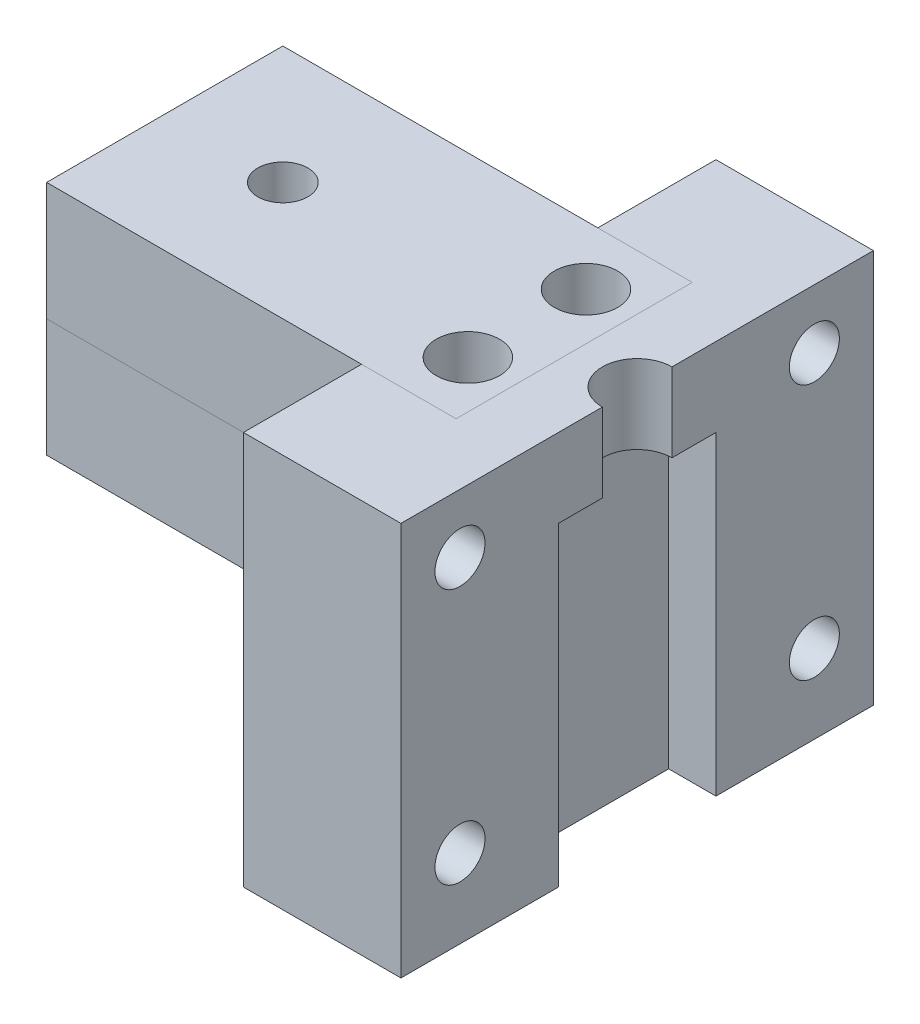
ISO-10303-21;
HEADER;
FILE_DESCRIPTION(('STEP AP214'),'2;1');
FILE_NAME('part.step','',(''),(''),'','','');
FILE_SCHEMA(('AUTOMOTIVE_DESIGN { 1 0 10303 214 1 1 1 1 }'));
ENDSEC;
DATA;
#1=APPLICATION_CONTEXT('core data for automotive mechanical design processes');
#2=APPLICATION_PROTOCOL_DEFINITION('international standard','automotive_design',2000,#1);
#3=PRODUCT_CONTEXT('',#1,'mechanical');
#4=PRODUCT('Part','Part','',(#3));
#5=PRODUCT_RELATED_PRODUCT_CATEGORY('part','',(#4));
#6=PRODUCT_DEFINITION_FORMATION('','',#4);
#7=PRODUCT_DEFINITION_CONTEXT('part definition',#1,'design');
#8=PRODUCT_DEFINITION('design','',#6,#7);
#9=PRODUCT_DEFINITION_SHAPE('','',#8);
#10=(LENGTH_UNIT() NAMED_UNIT(*) SI_UNIT(.MILLI.,.METRE.));
#11=(NAMED_UNIT(*) PLANE_ANGLE_UNIT() SI_UNIT($,.RADIAN.));
#12=(NAMED_UNIT(*) SI_UNIT($,.STERADIAN.) SOLID_ANGLE_UNIT());
#13=UNCERTAINTY_MEASURE_WITH_UNIT(LENGTH_MEASURE(1.E-05),#10,'distance_accuracy_value','');
#14=(GEOMETRIC_REPRESENTATION_CONTEXT(3) GLOBAL_UNCERTAINTY_ASSIGNED_CONTEXT((#13)) GLOBAL_UNIT_ASSIGNED_CONTEXT((#10,
#11,#12)) REPRESENTATION_CONTEXT('',''));
#15=CARTESIAN_POINT('',(0.,0.,0.));
#16=DIRECTION('',(0.,0.,1.));
#17=DIRECTION('',(1.,0.,0.));
#18=AXIS2_PLACEMENT_3D('',#15,#16,#17);
#19=CARTESIAN_POINT('',(-5.08,0.,0.));
#20=DIRECTION('',(-1.,0.,0.));
#21=DIRECTION('',(0.,0.,1.));
#22=AXIS2_PLACEMENT_3D('',#19,#20,#21);
#23=PLANE('',#22);
#24=DIRECTION('',(0.,-1.,0.));
#25=VECTOR('',#24,1.);
#26=CARTESIAN_POINT('',(-5.08,0.,-9.525));
#27=LINE('',#26,#25);
#28=CARTESIAN_POINT('',(-5.08000000002085,0.,-9.525));
#29=VERTEX_POINT('',#28);
#30=CARTESIAN_POINT('',(-5.08000000002085,-9.525,-9.525));
#31=VERTEX_POINT('',#30);
#32=EDGE_CURVE('E123',#29,#31,#27,.T.);
#33=ORIENTED_EDGE('',*,*,#32,.F.);
#34=DIRECTION('',(0.,0.,-1.));
#35=VECTOR('',#34,1.);
#36=CARTESIAN_POINT('',(-5.08,0.,-9.525));
#37=LINE('',#36,#35);
#38=CARTESIAN_POINT('',(-5.08000000002085,0.,9.525));
#39=VERTEX_POINT('',#38);
#40=EDGE_CURVE('E79',#39,#29,#37,.T.);
#41=ORIENTED_EDGE('',*,*,#40,.F.);
#42=DIRECTION('',(0.,-1.,0.));
#43=VECTOR('',#42,1.);
#44=CARTESIAN_POINT('',(-5.08000000002085,-9.525,9.525));
#45=LINE('',#44,#43);
#46=CARTESIAN_POINT('',(-5.08000000002085,-9.525,9.525));
#47=VERTEX_POINT('',#46);
#48=EDGE_CURVE('E184',#39,#47,#45,.T.);
#49=ORIENTED_EDGE('',*,*,#48,.T.);
#50=DIRECTION('',(0.,0.,1.));
#51=VECTOR('',#50,1.);
#52=CARTESIAN_POINT('',(-5.08,-9.525,-9.525));
#53=LINE('',#52,#51);
#54=EDGE_CURVE('E159',#31,#47,#53,.T.);
#55=ORIENTED_EDGE('',*,*,#54,.F.);
#56=EDGE_LOOP('',(#33,#41,#49,#55));
#57=FACE_BOUND('',#56,.T.);
#58=ADVANCED_FACE('F56',(#57),#23,.F.);
#59=CARTESIAN_POINT('',(-5.08,-9.525,-9.525));
#60=DIRECTION('',(0.,-1.,0.));
#61=DIRECTION('',(0.,0.,-1.));
#62=AXIS2_PLACEMENT_3D('',#59,#60,#61);
#63=PLANE('',#62);
#64=CARTESIAN_POINT('',(-8.89,-9.525,4.7625));
#65=DIRECTION('',(0.,1.,0.));
#66=DIRECTION('',(0.,0.,1.));
#67=AXIS2_PLACEMENT_3D('',#64,#65,#66);
#68=CIRCLE('',#67,2.5527);
#69=CARTESIAN_POINT('',(-8.89,-9.525,7.3152));
#70=VERTEX_POINT('',#69);
#71=EDGE_CURVE('E182',#70,#70,#68,.T.);
#72=ORIENTED_EDGE('',*,*,#71,.T.);
#73=EDGE_LOOP('',(#72));
#74=FACE_BOUND('',#73,.T.);
#75=CARTESIAN_POINT('',(-8.89,-9.525,-4.7625));
#76=DIRECTION('',(0.,1.,0.));
#77=DIRECTION('',(0.,0.,1.));
#78=AXIS2_PLACEMENT_3D('',#75,#76,#77);
#79=CIRCLE('',#78,2.5527);
#80=CARTESIAN_POINT('',(-8.89,-9.525,-2.2098));
#81=VERTEX_POINT('',#80);
#82=EDGE_CURVE('E180',#81,#81,#79,.T.);
#83=ORIENTED_EDGE('',*,*,#82,.T.);
#84=EDGE_LOOP('',(#83));
#85=FACE_BOUND('',#84,.T.);
#86=DIRECTION('',(0.,0.,1.));
#87=VECTOR('',#86,1.);
#88=CARTESIAN_POINT('',(-12.7,-9.525,-9.52499999999999));
#89=LINE('',#88,#87);
#90=CARTESIAN_POINT('',(-12.6999999999953,-9.525,-9.52499999999999));
#91=VERTEX_POINT('',#90);
#92=CARTESIAN_POINT('',(-12.6999999999953,-9.525,9.525));
#93=VERTEX_POINT('',#92);
#94=EDGE_CURVE('E135',#91,#93,#89,.T.);
#95=ORIENTED_EDGE('',*,*,#94,.F.);
#96=DIRECTION('',(-1.,0.,0.));
#97=VECTOR('',#96,1.);
#98=CARTESIAN_POINT('',(500000.,-9.525,-9.52500000006829));
#99=LINE('',#98,#97);
#100=EDGE_CURVE('E126',#31,#91,#99,.T.);
#101=ORIENTED_EDGE('',*,*,#100,.F.);
#102=ORIENTED_EDGE('',*,*,#54,.T.);
#103=DIRECTION('',(-1.,0.,0.));
#104=VECTOR('',#103,1.);
#105=CARTESIAN_POINT('',(500000.,-9.525,9.5249999999317));
#106=LINE('',#105,#104);
#107=EDGE_CURVE('E138',#47,#93,#106,.T.);
#108=ORIENTED_EDGE('',*,*,#107,.T.);
#109=EDGE_LOOP('',(#95,#101,#102,#108));
#110=FACE_BOUND('',#109,.T.);
#111=ADVANCED_FACE('F136',(#74,#85,#110),#63,.T.);
#112=CARTESIAN_POINT('',(-12.7,-31.75,19.05));
#113=DIRECTION('',(-1.,0.,0.));
#114=DIRECTION('',(0.,0.,1.));
#115=AXIS2_PLACEMENT_3D('',#112,#113,#114);
#116=PLANE('',#115);
#117=DIRECTION('',(0.,1.,0.));
#118=VECTOR('',#117,1.);
#119=CARTESIAN_POINT('',(-12.6999999999953,-9.525,-9.52499999999999));
#120=LINE('',#119,#118);
#121=CARTESIAN_POINT('',(-12.6999999999953,-19.05,-9.525));
#122=VERTEX_POINT('',#121);
#123=EDGE_CURVE('E142',#122,#91,#120,.T.);
#124=ORIENTED_EDGE('',*,*,#123,.T.);
#125=ORIENTED_EDGE('',*,*,#94,.T.);
#126=DIRECTION('',(0.,-1.,0.));
#127=VECTOR('',#126,1.);
#128=CARTESIAN_POINT('',(-12.6999999999953,-9.525,9.525));
#129=LINE('',#128,#127);
#130=CARTESIAN_POINT('',(-12.6999999999953,-19.05,9.52500000000001));
#131=VERTEX_POINT('',#130);
#132=EDGE_CURVE('E141',#93,#131,#129,.T.);
#133=ORIENTED_EDGE('',*,*,#132,.T.);
#134=DIRECTION('',(0.,0.,-1.));
#135=VECTOR('',#134,1.);
#136=CARTESIAN_POINT('',(-12.6999999999953,-19.05,-9.525));
#137=LINE('',#136,#135);
#138=EDGE_CURVE('E115',#131,#122,#137,.T.);
#139=ORIENTED_EDGE('',*,*,#138,.T.);
#140=EDGE_LOOP('',(#124,#125,#133,#139));
#141=FACE_BOUND('',#140,.T.);
#142=ADVANCED_FACE('F144',(#141),#116,.F.);
#143=CARTESIAN_POINT('',(500000.,-9.525,-9.52500000006829));
#144=DIRECTION('',(0.,0.,-1.));
#145=DIRECTION('',(0.,1.,0.));
#146=AXIS2_PLACEMENT_3D('',#143,#144,#145);
#147=PLANE('',#146);
#148=ORIENTED_EDGE('',*,*,#123,.F.);
#149=DIRECTION('',(-1.,0.,0.));
#150=VECTOR('',#149,1.);
#151=CARTESIAN_POINT('',(500000.,-19.05,-9.52500000006829));
#152=LINE('',#151,#150);
#153=CARTESIAN_POINT('',(-38.1,-19.05,-9.52499999999999));
#154=VERTEX_POINT('',#153);
#155=EDGE_CURVE('E105',#122,#154,#152,.T.);
#156=ORIENTED_EDGE('',*,*,#155,.T.);
#157=DIRECTION('',(0.,-1.,0.));
#158=VECTOR('',#157,1.);
#159=CARTESIAN_POINT('',(-38.1,-9.525,-9.52499999999999));
#160=LINE('',#159,#158);
#161=CARTESIAN_POINT('',(-38.1,-9.525,-9.52499999999999));
#162=VERTEX_POINT('',#161);
#163=EDGE_CURVE('E148',#162,#154,#160,.T.);
#164=ORIENTED_EDGE('',*,*,#163,.F.);
#165=EDGE_CURVE('E130',#91,#162,#99,.T.);
#166=ORIENTED_EDGE('',*,*,#165,.F.);
#167=EDGE_LOOP('',(#148,#156,#164,#166));
#168=FACE_BOUND('',#167,.T.);
#169=ADVANCED_FACE('F146',(#168),#147,.T.);
#170=CARTESIAN_POINT('',(500000.,-19.05,-9.52500000006829));
#171=DIRECTION('',(0.,-1.,0.));
#172=DIRECTION('',(0.,0.,-1.));
#173=AXIS2_PLACEMENT_3D('',#170,#171,#172);
#174=PLANE('',#173);
#175=CARTESIAN_POINT('',(-28.575,-19.05,0.));
#176=DIRECTION('',(0.,-1.,0.));
#177=DIRECTION('',(0.,0.,-1.));
#178=AXIS2_PLACEMENT_3D('',#175,#176,#177);
#179=CIRCLE('',#178,2.01929999999999);
#180=CARTESIAN_POINT('',(-28.575,-19.05,-2.01929999999999));
#181=VERTEX_POINT('',#180);
#182=EDGE_CURVE('E210',#181,#181,#179,.T.);
#183=ORIENTED_EDGE('',*,*,#182,.F.);
#184=EDGE_LOOP('',(#183));
#185=FACE_BOUND('',#184,.T.);
#186=ORIENTED_EDGE('',*,*,#138,.F.);
#187=DIRECTION('',(-1.,0.,0.));
#188=VECTOR('',#187,1.);
#189=CARTESIAN_POINT('',(500000.,-19.05,9.52499999993171));
#190=LINE('',#189,#188);
#191=CARTESIAN_POINT('',(-38.1,-19.05,9.52500000000001));
#192=VERTEX_POINT('',#191);
#193=EDGE_CURVE('E155',#131,#192,#190,.T.);
#194=ORIENTED_EDGE('',*,*,#193,.T.);
#195=DIRECTION('',(0.,0.,1.));
#196=VECTOR('',#195,1.);
#197=CARTESIAN_POINT('',(-38.1,-19.05,-9.52499999999999));
#198=LINE('',#197,#196);
#199=EDGE_CURVE('E169',#154,#192,#198,.T.);
#200=ORIENTED_EDGE('',*,*,#199,.F.);
#201=ORIENTED_EDGE('',*,*,#155,.F.);
#202=EDGE_LOOP('',(#186,#194,#200,#201));
#203=FACE_BOUND('',#202,.T.);
#204=ADVANCED_FACE('F58',(#185,#203),#174,.T.);
#205=CARTESIAN_POINT('',(500000.,-9.525,9.5249999999317));
#206=DIRECTION('',(0.,0.,1.));
#207=DIRECTION('',(0.,-1.,0.));
#208=AXIS2_PLACEMENT_3D('',#205,#206,#207);
#209=PLANE('',#208);
#210=ORIENTED_EDGE('',*,*,#132,.F.);
#211=CARTESIAN_POINT('',(-38.1,-9.525,9.525));
#212=VERTEX_POINT('',#211);
#213=EDGE_CURVE('E157',#93,#212,#106,.T.);
#214=ORIENTED_EDGE('',*,*,#213,.T.);
#215=DIRECTION('',(0.,1.,0.));
#216=VECTOR('',#215,1.);
#217=CARTESIAN_POINT('',(-38.1,-9.525,9.525));
#218=LINE('',#217,#216);
#219=EDGE_CURVE('E163',#192,#212,#218,.T.);
#220=ORIENTED_EDGE('',*,*,#219,.F.);
#221=ORIENTED_EDGE('',*,*,#193,.F.);
#222=EDGE_LOOP('',(#210,#214,#220,#221));
#223=FACE_BOUND('',#222,.T.);
#224=ADVANCED_FACE('F198',(#223),#209,.T.);
#225=CARTESIAN_POINT('',(500000.,-9.525,9.5249999999317));
#226=DIRECTION('',(0.,0.,1.));
#227=DIRECTION('',(1.,0.,0.));
#228=AXIS2_PLACEMENT_3D('',#225,#226,#227);
#229=PLANE('',#228);
#230=ORIENTED_EDGE('',*,*,#213,.F.);
#231=ORIENTED_EDGE('',*,*,#107,.F.);
#232=ORIENTED_EDGE('',*,*,#48,.F.);
#233=DIRECTION('',(-1.,0.,0.));
#234=VECTOR('',#233,1.);
#235=CARTESIAN_POINT('',(500000.,0.,9.5249999999317));
#236=LINE('',#235,#234);
#237=CARTESIAN_POINT('',(-38.1,0.,9.525));
#238=VERTEX_POINT('',#237);
#239=EDGE_CURVE('E160',#39,#238,#236,.T.);
#240=ORIENTED_EDGE('',*,*,#239,.T.);
#241=DIRECTION('',(0.,1.,0.));
#242=VECTOR('',#241,1.);
#243=CARTESIAN_POINT('',(-38.1,-9.525,9.525));
#244=LINE('',#243,#242);
#245=EDGE_CURVE('E168',#212,#238,#244,.T.);
#246=ORIENTED_EDGE('',*,*,#245,.F.);
#247=EDGE_LOOP('',(#230,#231,#232,#240,#246));
#248=FACE_BOUND('',#247,.T.);
#249=ADVANCED_FACE('F224',(#248),#229,.T.);
#250=CARTESIAN_POINT('',(-38.1,0.,0.));
#251=DIRECTION('',(-1.,0.,0.));
#252=DIRECTION('',(0.,0.,1.));
#253=AXIS2_PLACEMENT_3D('',#250,#251,#252);
#254=PLANE('',#253);
#255=DIRECTION('',(0.,0.,-1.));
#256=VECTOR('',#255,1.);
#257=CARTESIAN_POINT('',(-38.1,0.,9.525));
#258=LINE('',#257,#256);
#259=CARTESIAN_POINT('',(-38.1,0.,-9.52499999999999));
#260=VERTEX_POINT('',#259);
#261=EDGE_CURVE('E162',#238,#260,#258,.T.);
#262=ORIENTED_EDGE('',*,*,#261,.T.);
#263=DIRECTION('',(0.,-1.,0.));
#264=VECTOR('',#263,1.);
#265=CARTESIAN_POINT('',(-38.1,0.,-9.52499999999999));
#266=LINE('',#265,#264);
#267=EDGE_CURVE('E205',#260,#162,#266,.T.);
#268=ORIENTED_EDGE('',*,*,#267,.T.);
#269=ORIENTED_EDGE('',*,*,#163,.T.);
#270=ORIENTED_EDGE('',*,*,#199,.T.);
#271=ORIENTED_EDGE('',*,*,#219,.T.);
#272=ORIENTED_EDGE('',*,*,#245,.T.);
#273=EDGE_LOOP('',(#262,#268,#269,#270,#271,#272));
#274=FACE_BOUND('',#273,.T.);
#275=ADVANCED_FACE('F204',(#274),#254,.T.);
#276=CARTESIAN_POINT('',(500000.,0.,-9.52500000006829));
#277=DIRECTION('',(0.,0.,-1.));
#278=DIRECTION('',(0.,1.,0.));
#279=AXIS2_PLACEMENT_3D('',#276,#277,#278);
#280=PLANE('',#279);
#281=ORIENTED_EDGE('',*,*,#267,.F.);
#282=DIRECTION('',(-1.,0.,0.));
#283=VECTOR('',#282,1.);
#284=CARTESIAN_POINT('',(500000.,0.,-9.52500000006829));
#285=LINE('',#284,#283);
#286=EDGE_CURVE('E73',#29,#260,#285,.T.);
#287=ORIENTED_EDGE('',*,*,#286,.F.);
#288=ORIENTED_EDGE('',*,*,#32,.T.);
#289=ORIENTED_EDGE('',*,*,#100,.T.);
#290=ORIENTED_EDGE('',*,*,#165,.T.);
#291=EDGE_LOOP('',(#281,#287,#288,#289,#290));
#292=FACE_BOUND('',#291,.T.);
#293=ADVANCED_FACE('F128',(#292),#280,.T.);
#294=CARTESIAN_POINT('',(500000.,0.,9.5249999999317));
#295=DIRECTION('',(0.,1.,0.));
#296=DIRECTION('',(0.,0.,1.));
#297=AXIS2_PLACEMENT_3D('',#294,#295,#296);
#298=PLANE('',#297);
#299=CARTESIAN_POINT('',(-8.89,0.,4.7625));
#300=DIRECTION('',(0.,1.,0.));
#301=DIRECTION('',(0.,0.,1.));
#302=AXIS2_PLACEMENT_3D('',#299,#300,#301);
#303=CIRCLE('',#302,2.55269999999999);
#304=CARTESIAN_POINT('',(-8.89,0.,7.31519999999999));
#305=VERTEX_POINT('',#304);
#306=EDGE_CURVE('E13',#305,#305,#303,.T.);
#307=ORIENTED_EDGE('',*,*,#306,.F.);
#308=EDGE_LOOP('',(#307));
#309=FACE_BOUND('',#308,.T.);
#310=CARTESIAN_POINT('',(-8.89,0.,-4.7625));
#311=DIRECTION('',(0.,1.,0.));
#312=DIRECTION('',(0.,0.,1.));
#313=AXIS2_PLACEMENT_3D('',#310,#311,#312);
#314=CIRCLE('',#313,2.55269999999999);
#315=CARTESIAN_POINT('',(-8.89,0.,-2.20980000000001));
#316=VERTEX_POINT('',#315);
#317=EDGE_CURVE('E66',#316,#316,#314,.T.);
#318=ORIENTED_EDGE('',*,*,#317,.F.);
#319=EDGE_LOOP('',(#318));
#320=FACE_BOUND('',#319,.T.);
#321=CARTESIAN_POINT('',(-28.575,0.,0.));
#322=DIRECTION('',(0.,1.,0.));
#323=DIRECTION('',(0.,0.,1.));
#324=AXIS2_PLACEMENT_3D('',#321,#322,#323);
#325=CIRCLE('',#324,2.01929999999999);
#326=CARTESIAN_POINT('',(-28.575,0.,2.01929999999999));
#327=VERTEX_POINT('',#326);
#328=EDGE_CURVE('E179',#327,#327,#325,.T.);
#329=ORIENTED_EDGE('',*,*,#328,.F.);
#330=EDGE_LOOP('',(#329));
#331=FACE_BOUND('',#330,.T.);
#332=ORIENTED_EDGE('',*,*,#239,.F.);
#333=ORIENTED_EDGE('',*,*,#40,.T.);
#334=ORIENTED_EDGE('',*,*,#286,.T.);
#335=ORIENTED_EDGE('',*,*,#261,.F.);
#336=EDGE_LOOP('',(#332,#333,#334,#335));
#337=FACE_BOUND('',#336,.T.);
#338=ADVANCED_FACE('F217',(#309,#320,#331,#337),#298,.T.);
#339=CARTESIAN_POINT('',(-28.575,0.,0.));
#340=DIRECTION('',(0.,1.,0.));
#341=DIRECTION('',(0.,0.,1.));
#342=AXIS2_PLACEMENT_3D('',#339,#340,#341);
#343=CYLINDRICAL_SURFACE('',#342,2.01929999999999);
#344=ORIENTED_EDGE('',*,*,#182,.T.);
#345=EDGE_LOOP('',(#344));
#346=FACE_BOUND('',#345,.T.);
#347=ORIENTED_EDGE('',*,*,#328,.T.);
#348=EDGE_LOOP('',(#347));
#349=FACE_BOUND('',#348,.T.);
#350=ADVANCED_FACE('F215',(#346,#349),#343,.F.);
#351=CARTESIAN_POINT('',(-8.89,0.,-4.7625));
#352=DIRECTION('',(0.,1.,0.));
#353=DIRECTION('',(0.,0.,1.));
#354=AXIS2_PLACEMENT_3D('',#351,#352,#353);
#355=CYLINDRICAL_SURFACE('',#354,2.55269999999999);
#356=ORIENTED_EDGE('',*,*,#82,.F.);
#357=EDGE_LOOP('',(#356));
#358=FACE_BOUND('',#357,.T.);
#359=ORIENTED_EDGE('',*,*,#317,.T.);
#360=EDGE_LOOP('',(#359));
#361=FACE_BOUND('',#360,.T.);
#362=ADVANCED_FACE('F247',(#358,#361),#355,.F.);
#363=CARTESIAN_POINT('',(-8.89,0.,4.7625));
#364=DIRECTION('',(0.,1.,0.));
#365=DIRECTION('',(0.,0.,1.));
#366=AXIS2_PLACEMENT_3D('',#363,#364,#365);
#367=CYLINDRICAL_SURFACE('',#366,2.55269999999999);
#368=ORIENTED_EDGE('',*,*,#71,.F.);
#369=EDGE_LOOP('',(#368));
#370=FACE_BOUND('',#369,.T.);
#371=ORIENTED_EDGE('',*,*,#306,.T.);
#372=EDGE_LOOP('',(#371));
#373=FACE_BOUND('',#372,.T.);
#374=ADVANCED_FACE('F250',(#370,#373),#367,.F.);
#375=CLOSED_SHELL('',(#58,#111,#142,#169,#204,#224,#249,#275,#293,#338,#350,#362,#374));
#376=MANIFOLD_SOLID_BREP('B2',#375);
#377=CARTESIAN_POINT('',(0.,-31.75,19.05));
#378=DIRECTION('',(1.,0.,0.));
#379=DIRECTION('',(0.,0.,-1.));
#380=AXIS2_PLACEMENT_3D('',#377,#378,#379);
#381=PLANE('',#380);
#382=CARTESIAN_POINT('',(0.,-25.4,-14.2875));
#383=DIRECTION('',(-1.,0.,0.));
#384=DIRECTION('',(0.,0.,1.));
#385=AXIS2_PLACEMENT_3D('',#382,#383,#384);
#386=CIRCLE('',#385,2.0193);
#387=CARTESIAN_POINT('',(0.,-25.4,-12.2682));
#388=VERTEX_POINT('',#387);
#389=EDGE_CURVE('E528',#388,#388,#386,.T.);
#390=ORIENTED_EDGE('',*,*,#389,.T.);
#391=EDGE_LOOP('',(#390));
#392=FACE_BOUND('',#391,.T.);
#393=CARTESIAN_POINT('',(0.,-4.7625,-14.2875));
#394=DIRECTION('',(-1.,0.,0.));
#395=DIRECTION('',(0.,0.,1.));
#396=AXIS2_PLACEMENT_3D('',#393,#394,#395);
#397=CIRCLE('',#396,2.0193);
#398=CARTESIAN_POINT('',(0.,-4.7625,-12.2682));
#399=VERTEX_POINT('',#398);
#400=EDGE_CURVE('E534',#399,#399,#397,.T.);
#401=ORIENTED_EDGE('',*,*,#400,.T.);
#402=EDGE_LOOP('',(#401));
#403=FACE_BOUND('',#402,.T.);
#404=DIRECTION('',(0.,1.,0.));
#405=VECTOR('',#404,1.);
#406=CARTESIAN_POINT('',(0.,0.,-2.8067));
#407=LINE('',#406,#405);
#408=CARTESIAN_POINT('',(0.,-6.35,-2.8067));
#409=VERTEX_POINT('',#408);
#410=CARTESIAN_POINT('',(0.,0.,-2.8067));
#411=VERTEX_POINT('',#410);
#412=EDGE_CURVE('E54',#409,#411,#407,.T.);
#413=ORIENTED_EDGE('',*,*,#412,.F.);
#414=DIRECTION('',(0.,0.,1.));
#415=VECTOR('',#414,1.);
#416=CARTESIAN_POINT('',(0.,-6.35,6.35));
#417=LINE('',#416,#415);
#418=CARTESIAN_POINT('',(0.,-6.35,-6.35));
#419=VERTEX_POINT('',#418);
#420=EDGE_CURVE('E542',#419,#409,#417,.T.);
#421=ORIENTED_EDGE('',*,*,#420,.F.);
#422=DIRECTION('',(0.,-1.,0.));
#423=VECTOR('',#422,1.);
#424=CARTESIAN_POINT('',(0.,-6.35,-6.35));
#425=LINE('',#424,#423);
#426=CARTESIAN_POINT('',(0.,-31.75,-6.35));
#427=VERTEX_POINT('',#426);
#428=EDGE_CURVE('E563',#419,#427,#425,.T.);
#429=ORIENTED_EDGE('',*,*,#428,.T.);
#430=DIRECTION('',(0.,0.,-1.));
#431=VECTOR('',#430,1.);
#432=CARTESIAN_POINT('',(0.,-31.75,19.05));
#433=LINE('',#432,#431);
#434=CARTESIAN_POINT('',(0.,-31.75,-19.05));
#435=VERTEX_POINT('',#434);
#436=EDGE_CURVE('E575',#427,#435,#433,.T.);
#437=ORIENTED_EDGE('',*,*,#436,.T.);
#438=DIRECTION('',(0.,1.,0.));
#439=VECTOR('',#438,1.);
#440=CARTESIAN_POINT('',(0.,-31.75,-19.05));
#441=LINE('',#440,#439);
#442=CARTESIAN_POINT('',(0.,0.,-19.05));
#443=VERTEX_POINT('',#442);
#444=EDGE_CURVE('E604',#435,#443,#441,.T.);
#445=ORIENTED_EDGE('',*,*,#444,.T.);
#446=DIRECTION('',(0.,0.,-1.));
#447=VECTOR('',#446,1.);
#448=CARTESIAN_POINT('',(0.,0.,19.05));
#449=LINE('',#448,#447);
#450=EDGE_CURVE('E589',#411,#443,#449,.T.);
#451=ORIENTED_EDGE('',*,*,#450,.F.);
#452=EDGE_LOOP('',(#413,#421,#429,#437,#445,#451));
#453=FACE_BOUND('',#452,.T.);
#454=ADVANCED_FACE('F358',(#392,#403,#453),#381,.T.);
#455=CARTESIAN_POINT('',(0.,-31.75,19.05));
#456=DIRECTION('',(0.,0.,1.));
#457=DIRECTION('',(1.,0.,0.));
#458=AXIS2_PLACEMENT_3D('',#455,#456,#457);
#459=PLANE('',#458);
#460=DIRECTION('',(1.,0.,0.));
#461=VECTOR('',#460,1.);
#462=CARTESIAN_POINT('',(0.,0.,19.05));
#463=LINE('',#462,#461);
#464=CARTESIAN_POINT('',(-12.7,0.,19.05));
#465=VERTEX_POINT('',#464);
#466=CARTESIAN_POINT('',(0.,0.,19.05));
#467=VERTEX_POINT('',#466);
#468=EDGE_CURVE('E566',#465,#467,#463,.T.);
#469=ORIENTED_EDGE('',*,*,#468,.F.);
#470=DIRECTION('',(0.,1.,0.));
#471=VECTOR('',#470,1.);
#472=CARTESIAN_POINT('',(-12.7,-31.75,19.05));
#473=LINE('',#472,#471);
#474=CARTESIAN_POINT('',(-12.7,-31.75,19.05));
#475=VERTEX_POINT('',#474);
#476=EDGE_CURVE('E599',#475,#465,#473,.T.);
#477=ORIENTED_EDGE('',*,*,#476,.F.);
#478=DIRECTION('',(1.,0.,0.));
#479=VECTOR('',#478,1.);
#480=CARTESIAN_POINT('',(0.,-31.75,19.05));
#481=LINE('',#480,#479);
#482=CARTESIAN_POINT('',(0.,-31.75,19.05));
#483=VERTEX_POINT('',#482);
#484=EDGE_CURVE('E572',#475,#483,#481,.T.);
#485=ORIENTED_EDGE('',*,*,#484,.T.);
#486=DIRECTION('',(0.,1.,0.));
#487=VECTOR('',#486,1.);
#488=CARTESIAN_POINT('',(0.,-31.75,19.05));
#489=LINE('',#488,#487);
#490=EDGE_CURVE('E586',#483,#467,#489,.T.);
#491=ORIENTED_EDGE('',*,*,#490,.T.);
#492=EDGE_LOOP('',(#469,#477,#485,#491));
#493=FACE_BOUND('',#492,.T.);
#494=ADVANCED_FACE('F360',(#493),#459,.T.);
#495=CARTESIAN_POINT('',(-12.7,-31.75,19.05));
#496=DIRECTION('',(-1.,0.,0.));
#497=DIRECTION('',(0.,0.,1.));
#498=AXIS2_PLACEMENT_3D('',#495,#496,#497);
#499=PLANE('',#498);
#500=DIRECTION('',(0.,-1.,0.));
#501=VECTOR('',#500,1.);
#502=CARTESIAN_POINT('',(-12.7,0.,-9.525));
#503=LINE('',#502,#501);
#504=CARTESIAN_POINT('',(-12.7,0.,-9.525));
#505=VERTEX_POINT('',#504);
#506=CARTESIAN_POINT('',(-12.7,-9.525,-9.52499999999999));
#507=VERTEX_POINT('',#506);
#508=EDGE_CURVE('E488',#505,#507,#503,.T.);
#509=ORIENTED_EDGE('',*,*,#508,.F.);
#510=DIRECTION('',(0.,0.,1.));
#511=VECTOR('',#510,1.);
#512=CARTESIAN_POINT('',(-12.7,0.,19.05));
#513=LINE('',#512,#511);
#514=CARTESIAN_POINT('',(-12.7,0.,-19.05));
#515=VERTEX_POINT('',#514);
#516=EDGE_CURVE('E576',#515,#505,#513,.T.);
#517=ORIENTED_EDGE('',*,*,#516,.F.);
#518=DIRECTION('',(0.,1.,0.));
#519=VECTOR('',#518,1.);
#520=CARTESIAN_POINT('',(-12.7,-31.75,-19.05));
#521=LINE('',#520,#519);
#522=CARTESIAN_POINT('',(-12.7,-31.75,-19.05));
#523=VERTEX_POINT('',#522);
#524=EDGE_CURVE('E602',#523,#515,#521,.T.);
#525=ORIENTED_EDGE('',*,*,#524,.F.);
#526=DIRECTION('',(0.,0.,1.));
#527=VECTOR('',#526,1.);
#528=CARTESIAN_POINT('',(-12.7,-31.75,19.05));
#529=LINE('',#528,#527);
#530=EDGE_CURVE('E583',#523,#475,#529,.T.);
#531=ORIENTED_EDGE('',*,*,#530,.T.);
#532=ORIENTED_EDGE('',*,*,#476,.T.);
#533=CARTESIAN_POINT('',(-12.7,0.,9.525));
#534=VERTEX_POINT('',#533);
#535=EDGE_CURVE('E596',#534,#465,#513,.T.);
#536=ORIENTED_EDGE('',*,*,#535,.F.);
#537=DIRECTION('',(0.,1.,0.));
#538=VECTOR('',#537,1.);
#539=CARTESIAN_POINT('',(-12.7,0.,9.525));
#540=LINE('',#539,#538);
#541=CARTESIAN_POINT('',(-12.7,-9.525,9.525));
#542=VERTEX_POINT('',#541);
#543=EDGE_CURVE('E493',#542,#534,#540,.T.);
#544=ORIENTED_EDGE('',*,*,#543,.F.);
#545=DIRECTION('',(0.,0.,1.));
#546=VECTOR('',#545,1.);
#547=CARTESIAN_POINT('',(-12.7,-9.525,-9.52499999999999));
#548=LINE('',#547,#546);
#549=EDGE_CURVE('E501',#507,#542,#548,.T.);
#550=ORIENTED_EDGE('',*,*,#549,.F.);
#551=EDGE_LOOP('',(#509,#517,#525,#531,#532,#536,#544,#550));
#552=FACE_BOUND('',#551,.T.);
#553=CARTESIAN_POINT('',(-12.7,-4.7625,14.2875));
#554=DIRECTION('',(-1.,0.,0.));
#555=DIRECTION('',(0.,0.,1.));
#556=AXIS2_PLACEMENT_3D('',#553,#554,#555);
#557=CIRCLE('',#556,2.0193);
#558=CARTESIAN_POINT('',(-12.7,-4.7625,16.3068));
#559=VERTEX_POINT('',#558);
#560=EDGE_CURVE('E507',#559,#559,#557,.T.);
#561=ORIENTED_EDGE('',*,*,#560,.F.);
#562=EDGE_LOOP('',(#561));
#563=FACE_BOUND('',#562,.T.);
#564=CARTESIAN_POINT('',(-12.7,-25.4,14.2875));
#565=DIRECTION('',(-1.,0.,0.));
#566=DIRECTION('',(0.,0.,1.));
#567=AXIS2_PLACEMENT_3D('',#564,#565,#566);
#568=CIRCLE('',#567,2.0193);
#569=CARTESIAN_POINT('',(-12.7,-25.4,16.3068));
#570=VERTEX_POINT('',#569);
#571=EDGE_CURVE('E519',#570,#570,#568,.T.);
#572=ORIENTED_EDGE('',*,*,#571,.F.);
#573=EDGE_LOOP('',(#572));
#574=FACE_BOUND('',#573,.T.);
#575=CARTESIAN_POINT('',(-12.7,-25.4,-14.2875));
#576=DIRECTION('',(-1.,0.,0.));
#577=DIRECTION('',(0.,0.,1.));
#578=AXIS2_PLACEMENT_3D('',#575,#576,#577);
#579=CIRCLE('',#578,2.0193);
#580=CARTESIAN_POINT('',(-12.7,-25.4,-12.2682));
#581=VERTEX_POINT('',#580);
#582=EDGE_CURVE('E525',#581,#581,#579,.T.);
#583=ORIENTED_EDGE('',*,*,#582,.F.);
#584=EDGE_LOOP('',(#583));
#585=FACE_BOUND('',#584,.T.);
#586=CARTESIAN_POINT('',(-12.7,-4.7625,-14.2875));
#587=DIRECTION('',(-1.,0.,0.));
#588=DIRECTION('',(0.,0.,1.));
#589=AXIS2_PLACEMENT_3D('',#586,#587,#588);
#590=CIRCLE('',#589,2.0193);
#591=CARTESIAN_POINT('',(-12.7,-4.7625,-12.2682));
#592=VERTEX_POINT('',#591);
#593=EDGE_CURVE('E531',#592,#592,#590,.T.);
#594=ORIENTED_EDGE('',*,*,#593,.F.);
#595=EDGE_LOOP('',(#594));
#596=FACE_BOUND('',#595,.T.);
#597=ADVANCED_FACE('F649',(#552,#563,#574,#585,#596),#499,.T.);
#598=CARTESIAN_POINT('',(0.,-31.75,-19.05));
#599=DIRECTION('',(0.,0.,-1.));
#600=DIRECTION('',(-1.,0.,0.));
#601=AXIS2_PLACEMENT_3D('',#598,#599,#600);
#602=PLANE('',#601);
#603=DIRECTION('',(-1.,0.,0.));
#604=VECTOR('',#603,1.);
#605=CARTESIAN_POINT('',(0.,0.,-19.05));
#606=LINE('',#605,#604);
#607=EDGE_CURVE('E593',#443,#515,#606,.T.);
#608=ORIENTED_EDGE('',*,*,#607,.F.);
#609=ORIENTED_EDGE('',*,*,#444,.F.);
#610=DIRECTION('',(-1.,0.,0.));
#611=VECTOR('',#610,1.);
#612=CARTESIAN_POINT('',(0.,-31.75,-19.05));
#613=LINE('',#612,#611);
#614=EDGE_CURVE('E580',#435,#523,#613,.T.);
#615=ORIENTED_EDGE('',*,*,#614,.T.);
#616=ORIENTED_EDGE('',*,*,#524,.T.);
#617=EDGE_LOOP('',(#608,#609,#615,#616));
#618=FACE_BOUND('',#617,.T.);
#619=ADVANCED_FACE('F640',(#618),#602,.T.);
#620=CARTESIAN_POINT('',(0.,-4.7625,14.2875));
#621=DIRECTION('',(-1.,0.,0.));
#622=DIRECTION('',(0.,0.,1.));
#623=AXIS2_PLACEMENT_3D('',#620,#621,#622);
#624=CIRCLE('',#623,2.0193);
#625=CARTESIAN_POINT('',(0.,-4.7625,16.3068));
#626=VERTEX_POINT('',#625);
#627=EDGE_CURVE('E516',#626,#626,#624,.T.);
#628=ORIENTED_EDGE('',*,*,#627,.T.);
#629=EDGE_LOOP('',(#628));
#630=FACE_BOUND('',#629,.T.);
#631=CARTESIAN_POINT('',(0.,-25.4,14.2875));
#632=DIRECTION('',(-1.,0.,0.));
#633=DIRECTION('',(0.,0.,1.));
#634=AXIS2_PLACEMENT_3D('',#631,#632,#633);
#635=CIRCLE('',#634,2.0193);
#636=CARTESIAN_POINT('',(0.,-25.4,16.3068));
#637=VERTEX_POINT('',#636);
#638=EDGE_CURVE('E522',#637,#637,#635,.T.);
#639=ORIENTED_EDGE('',*,*,#638,.T.);
#640=EDGE_LOOP('',(#639));
#641=FACE_BOUND('',#640,.T.);
#642=DIRECTION('',(0.,1.,0.));
#643=VECTOR('',#642,1.);
#644=CARTESIAN_POINT('',(0.,0.,2.8067));
#645=LINE('',#644,#643);
#646=CARTESIAN_POINT('',(0.,0.,2.8067));
#647=VERTEX_POINT('',#646);
#648=CARTESIAN_POINT('',(0.,-6.35,2.8067));
#649=VERTEX_POINT('',#648);
#650=EDGE_CURVE('E366',#647,#649,#645,.F.);
#651=ORIENTED_EDGE('',*,*,#650,.F.);
#652=EDGE_CURVE('E590',#467,#647,#449,.T.);
#653=ORIENTED_EDGE('',*,*,#652,.F.);
#654=ORIENTED_EDGE('',*,*,#490,.F.);
#655=CARTESIAN_POINT('',(0.,-31.75,6.35));
#656=VERTEX_POINT('',#655);
#657=EDGE_CURVE('E577',#483,#656,#433,.T.);
#658=ORIENTED_EDGE('',*,*,#657,.T.);
#659=DIRECTION('',(0.,-1.,0.));
#660=VECTOR('',#659,1.);
#661=CARTESIAN_POINT('',(0.,-6.35,6.35));
#662=LINE('',#661,#660);
#663=CARTESIAN_POINT('',(0.,-6.35,6.35));
#664=VERTEX_POINT('',#663);
#665=EDGE_CURVE('E555',#664,#656,#662,.T.);
#666=ORIENTED_EDGE('',*,*,#665,.F.);
#667=EDGE_CURVE('E546',#649,#664,#417,.T.);
#668=ORIENTED_EDGE('',*,*,#667,.F.);
#669=EDGE_LOOP('',(#651,#653,#654,#658,#666,#668));
#670=FACE_BOUND('',#669,.T.);
#671=ADVANCED_FACE('F617',(#630,#641,#670),#381,.T.);
#672=CARTESIAN_POINT('',(0.,-31.75,0.));
#673=DIRECTION('',(0.,-1.,0.));
#674=DIRECTION('',(0.,0.,-1.));
#675=AXIS2_PLACEMENT_3D('',#672,#673,#674);
#676=PLANE('',#675);
#677=DIRECTION('',(1.,0.,0.));
#678=VECTOR('',#677,1.);
#679=CARTESIAN_POINT('',(0.,-31.75,-6.35));
#680=LINE('',#679,#678);
#681=CARTESIAN_POINT('',(-3.81000000000001,-31.75,-6.35));
#682=VERTEX_POINT('',#681);
#683=EDGE_CURVE('E561',#682,#427,#680,.T.);
#684=ORIENTED_EDGE('',*,*,#683,.F.);
#685=DIRECTION('',(0.,0.,-1.));
#686=VECTOR('',#685,1.);
#687=CARTESIAN_POINT('',(-3.81,-31.75,6.35));
#688=LINE('',#687,#686);
#689=CARTESIAN_POINT('',(-3.81,-31.75,6.35));
#690=VERTEX_POINT('',#689);
#691=EDGE_CURVE('E558',#690,#682,#688,.T.);
#692=ORIENTED_EDGE('',*,*,#691,.F.);
#693=DIRECTION('',(-1.,0.,0.));
#694=VECTOR('',#693,1.);
#695=CARTESIAN_POINT('',(0.,-31.75,6.35));
#696=LINE('',#695,#694);
#697=EDGE_CURVE('E541',#656,#690,#696,.T.);
#698=ORIENTED_EDGE('',*,*,#697,.F.);
#699=ORIENTED_EDGE('',*,*,#657,.F.);
#700=ORIENTED_EDGE('',*,*,#484,.F.);
#701=ORIENTED_EDGE('',*,*,#530,.F.);
#702=ORIENTED_EDGE('',*,*,#614,.F.);
#703=ORIENTED_EDGE('',*,*,#436,.F.);
#704=EDGE_LOOP('',(#684,#692,#698,#699,#700,#701,#702,#703));
#705=FACE_BOUND('',#704,.T.);
#706=ADVANCED_FACE('F625',(#705),#676,.T.);
#707=CARTESIAN_POINT('',(0.,0.,0.));
#708=DIRECTION('',(0.,-1.,0.));
#709=DIRECTION('',(0.,0.,-1.));
#710=AXIS2_PLACEMENT_3D('',#707,#708,#709);
#711=PLANE('',#710);
#712=ORIENTED_EDGE('',*,*,#516,.T.);
#713=DIRECTION('',(-1.,0.,0.));
#714=VECTOR('',#713,1.);
#715=CARTESIAN_POINT('',(-5.08,0.,-9.525));
#716=LINE('',#715,#714);
#717=CARTESIAN_POINT('',(-5.08,0.,-9.525));
#718=VERTEX_POINT('',#717);
#719=EDGE_CURVE('E505',#718,#505,#716,.T.);
#720=ORIENTED_EDGE('',*,*,#719,.F.);
#721=DIRECTION('',(0.,0.,-1.));
#722=VECTOR('',#721,1.);
#723=CARTESIAN_POINT('',(-5.08,0.,-9.525));
#724=LINE('',#723,#722);
#725=CARTESIAN_POINT('',(-5.08,0.,9.525));
#726=VERTEX_POINT('',#725);
#727=EDGE_CURVE('E496',#726,#718,#724,.T.);
#728=ORIENTED_EDGE('',*,*,#727,.F.);
#729=DIRECTION('',(-1.,0.,0.));
#730=VECTOR('',#729,1.);
#731=CARTESIAN_POINT('',(-5.08,0.,9.525));
#732=LINE('',#731,#730);
#733=EDGE_CURVE('E508',#726,#534,#732,.T.);
#734=ORIENTED_EDGE('',*,*,#733,.T.);
#735=ORIENTED_EDGE('',*,*,#535,.T.);
#736=ORIENTED_EDGE('',*,*,#468,.T.);
#737=ORIENTED_EDGE('',*,*,#652,.T.);
#738=CARTESIAN_POINT('',(0.,0.,0.));
#739=DIRECTION('',(0.,1.,0.));
#740=DIRECTION('',(0.,0.,1.));
#741=AXIS2_PLACEMENT_3D('',#738,#739,#740);
#742=CIRCLE('',#741,2.8067);
#743=EDGE_CURVE('E380',#411,#647,#742,.T.);
#744=ORIENTED_EDGE('',*,*,#743,.F.);
#745=ORIENTED_EDGE('',*,*,#450,.T.);
#746=ORIENTED_EDGE('',*,*,#607,.T.);
#747=EDGE_LOOP('',(#712,#720,#728,#734,#735,#736,#737,#744,#745,#746));
#748=FACE_BOUND('',#747,.T.);
#749=ADVANCED_FACE('F643',(#748),#711,.F.);
#750=CARTESIAN_POINT('',(0.,-6.35,-6.35));
#751=DIRECTION('',(0.,0.,-1.));
#752=DIRECTION('',(-1.,0.,0.));
#753=AXIS2_PLACEMENT_3D('',#750,#751,#752);
#754=PLANE('',#753);
#755=ORIENTED_EDGE('',*,*,#683,.T.);
#756=ORIENTED_EDGE('',*,*,#428,.F.);
#757=DIRECTION('',(1.,0.,0.));
#758=VECTOR('',#757,1.);
#759=CARTESIAN_POINT('',(0.,-6.35,-6.35));
#760=LINE('',#759,#758);
#761=CARTESIAN_POINT('',(-3.81000000000001,-6.35,-6.35));
#762=VERTEX_POINT('',#761);
#763=EDGE_CURVE('E552',#762,#419,#760,.T.);
#764=ORIENTED_EDGE('',*,*,#763,.F.);
#765=DIRECTION('',(0.,-1.,0.));
#766=VECTOR('',#765,1.);
#767=CARTESIAN_POINT('',(-3.81000000000001,-6.35,-6.35));
#768=LINE('',#767,#766);
#769=EDGE_CURVE('E567',#762,#682,#768,.T.);
#770=ORIENTED_EDGE('',*,*,#769,.T.);
#771=EDGE_LOOP('',(#755,#756,#764,#770));
#772=FACE_BOUND('',#771,.T.);
#773=ADVANCED_FACE('F633',(#772),#754,.F.);
#774=CARTESIAN_POINT('',(-3.81,-6.35,6.35));
#775=DIRECTION('',(-1.,0.,0.));
#776=DIRECTION('',(0.,0.,1.));
#777=AXIS2_PLACEMENT_3D('',#774,#775,#776);
#778=PLANE('',#777);
#779=ORIENTED_EDGE('',*,*,#691,.T.);
#780=ORIENTED_EDGE('',*,*,#769,.F.);
#781=DIRECTION('',(0.,0.,-1.));
#782=VECTOR('',#781,1.);
#783=CARTESIAN_POINT('',(-3.81,-6.35,6.35));
#784=LINE('',#783,#782);
#785=CARTESIAN_POINT('',(-3.81,-6.35,6.35));
#786=VERTEX_POINT('',#785);
#787=EDGE_CURVE('E549',#786,#762,#784,.T.);
#788=ORIENTED_EDGE('',*,*,#787,.F.);
#789=DIRECTION('',(0.,-1.,0.));
#790=VECTOR('',#789,1.);
#791=CARTESIAN_POINT('',(-3.81,-6.35,6.35));
#792=LINE('',#791,#790);
#793=EDGE_CURVE('E569',#786,#690,#792,.T.);
#794=ORIENTED_EDGE('',*,*,#793,.T.);
#795=EDGE_LOOP('',(#779,#780,#788,#794));
#796=FACE_BOUND('',#795,.T.);
#797=ADVANCED_FACE('F629',(#796),#778,.F.);
#798=CARTESIAN_POINT('',(0.,-6.35,6.35));
#799=DIRECTION('',(0.,0.,1.));
#800=DIRECTION('',(1.,0.,0.));
#801=AXIS2_PLACEMENT_3D('',#798,#799,#800);
#802=PLANE('',#801);
#803=ORIENTED_EDGE('',*,*,#697,.T.);
#804=ORIENTED_EDGE('',*,*,#793,.F.);
#805=DIRECTION('',(-1.,0.,0.));
#806=VECTOR('',#805,1.);
#807=CARTESIAN_POINT('',(0.,-6.35,6.35));
#808=LINE('',#807,#806);
#809=EDGE_CURVE('E545',#664,#786,#808,.T.);
#810=ORIENTED_EDGE('',*,*,#809,.F.);
#811=ORIENTED_EDGE('',*,*,#665,.T.);
#812=EDGE_LOOP('',(#803,#804,#810,#811));
#813=FACE_BOUND('',#812,.T.);
#814=ADVANCED_FACE('F621',(#813),#802,.F.);
#815=CARTESIAN_POINT('',(0.,-6.35,0.));
#816=DIRECTION('',(0.,1.,0.));
#817=DIRECTION('',(0.,0.,1.));
#818=AXIS2_PLACEMENT_3D('',#815,#816,#817);
#819=PLANE('',#818);
#820=ORIENTED_EDGE('',*,*,#420,.T.);
#821=CARTESIAN_POINT('',(0.,-6.35,0.));
#822=DIRECTION('',(0.,1.,0.));
#823=DIRECTION('',(0.,0.,1.));
#824=AXIS2_PLACEMENT_3D('',#821,#822,#823);
#825=CIRCLE('',#824,2.8067);
#826=EDGE_CURVE('E538',#409,#649,#825,.T.);
#827=ORIENTED_EDGE('',*,*,#826,.T.);
#828=ORIENTED_EDGE('',*,*,#667,.T.);
#829=ORIENTED_EDGE('',*,*,#809,.T.);
#830=ORIENTED_EDGE('',*,*,#787,.T.);
#831=ORIENTED_EDGE('',*,*,#763,.T.);
#832=EDGE_LOOP('',(#820,#827,#828,#829,#830,#831));
#833=FACE_BOUND('',#832,.T.);
#834=ADVANCED_FACE('F613',(#833),#819,.F.);
#835=CARTESIAN_POINT('',(0.,0.,0.));
#836=DIRECTION('',(0.,1.,0.));
#837=DIRECTION('',(0.,0.,1.));
#838=AXIS2_PLACEMENT_3D('',#835,#836,#837);
#839=CYLINDRICAL_SURFACE('',#838,2.8067);
#840=ORIENTED_EDGE('',*,*,#412,.T.);
#841=ORIENTED_EDGE('',*,*,#743,.T.);
#842=ORIENTED_EDGE('',*,*,#650,.T.);
#843=ORIENTED_EDGE('',*,*,#826,.F.);
#844=EDGE_LOOP('',(#840,#841,#842,#843));
#845=FACE_BOUND('',#844,.T.);
#846=ADVANCED_FACE('F607',(#845),#839,.F.);
#847=CARTESIAN_POINT('',(-12.7,-4.7625,-14.2875));
#848=DIRECTION('',(-1.,0.,0.));
#849=DIRECTION('',(0.,0.,1.));
#850=AXIS2_PLACEMENT_3D('',#847,#848,#849);
#851=CYLINDRICAL_SURFACE('',#850,2.0193);
#852=ORIENTED_EDGE('',*,*,#400,.F.);
#853=EDGE_LOOP('',(#852));
#854=FACE_BOUND('',#853,.T.);
#855=ORIENTED_EDGE('',*,*,#593,.T.);
#856=EDGE_LOOP('',(#855));
#857=FACE_BOUND('',#856,.T.);
#858=ADVANCED_FACE('F706',(#854,#857),#851,.F.);
#859=CARTESIAN_POINT('',(-12.7,-25.4,-14.2875));
#860=DIRECTION('',(-1.,0.,0.));
#861=DIRECTION('',(0.,0.,1.));
#862=AXIS2_PLACEMENT_3D('',#859,#860,#861);
#863=CYLINDRICAL_SURFACE('',#862,2.0193);
#864=ORIENTED_EDGE('',*,*,#389,.F.);
#865=EDGE_LOOP('',(#864));
#866=FACE_BOUND('',#865,.T.);
#867=ORIENTED_EDGE('',*,*,#582,.T.);
#868=EDGE_LOOP('',(#867));
#869=FACE_BOUND('',#868,.T.);
#870=ADVANCED_FACE('F695',(#866,#869),#863,.F.);
#871=CARTESIAN_POINT('',(-12.7,-25.4,14.2875));
#872=DIRECTION('',(-1.,0.,0.));
#873=DIRECTION('',(0.,0.,1.));
#874=AXIS2_PLACEMENT_3D('',#871,#872,#873);
#875=CYLINDRICAL_SURFACE('',#874,2.0193);
#876=ORIENTED_EDGE('',*,*,#638,.F.);
#877=EDGE_LOOP('',(#876));
#878=FACE_BOUND('',#877,.T.);
#879=ORIENTED_EDGE('',*,*,#571,.T.);
#880=EDGE_LOOP('',(#879));
#881=FACE_BOUND('',#880,.T.);
#882=ADVANCED_FACE('F691',(#878,#881),#875,.F.);
#883=CARTESIAN_POINT('',(-12.7,-4.7625,14.2875));
#884=DIRECTION('',(-1.,0.,0.));
#885=DIRECTION('',(0.,0.,1.));
#886=AXIS2_PLACEMENT_3D('',#883,#884,#885);
#887=CYLINDRICAL_SURFACE('',#886,2.0193);
#888=ORIENTED_EDGE('',*,*,#627,.F.);
#889=EDGE_LOOP('',(#888));
#890=FACE_BOUND('',#889,.T.);
#891=ORIENTED_EDGE('',*,*,#560,.T.);
#892=EDGE_LOOP('',(#891));
#893=FACE_BOUND('',#892,.T.);
#894=ADVANCED_FACE('F694',(#890,#893),#887,.F.);
#895=CARTESIAN_POINT('',(-5.08,0.,-9.525));
#896=DIRECTION('',(0.,0.,-1.));
#897=DIRECTION('',(0.,1.,0.));
#898=AXIS2_PLACEMENT_3D('',#895,#896,#897);
#899=PLANE('',#898);
#900=ORIENTED_EDGE('',*,*,#508,.T.);
#901=DIRECTION('',(-1.,0.,0.));
#902=VECTOR('',#901,1.);
#903=CARTESIAN_POINT('',(-5.08,-9.525,-9.525));
#904=LINE('',#903,#902);
#905=CARTESIAN_POINT('',(-5.08,-9.525,-9.525));
#906=VERTEX_POINT('',#905);
#907=EDGE_CURVE('E498',#906,#507,#904,.T.);
#908=ORIENTED_EDGE('',*,*,#907,.F.);
#909=DIRECTION('',(0.,-1.,0.));
#910=VECTOR('',#909,1.);
#911=CARTESIAN_POINT('',(-5.08,0.,-9.525));
#912=LINE('',#911,#910);
#913=EDGE_CURVE('E489',#718,#906,#912,.T.);
#914=ORIENTED_EDGE('',*,*,#913,.F.);
#915=ORIENTED_EDGE('',*,*,#719,.T.);
#916=EDGE_LOOP('',(#900,#908,#914,#915));
#917=FACE_BOUND('',#916,.T.);
#918=ADVANCED_FACE('F656',(#917),#899,.F.);
#919=CARTESIAN_POINT('',(-5.08,0.,9.525));
#920=DIRECTION('',(0.,0.,1.));
#921=DIRECTION('',(1.,0.,0.));
#922=AXIS2_PLACEMENT_3D('',#919,#920,#921);
#923=PLANE('',#922);
#924=ORIENTED_EDGE('',*,*,#543,.T.);
#925=ORIENTED_EDGE('',*,*,#733,.F.);
#926=DIRECTION('',(0.,1.,0.));
#927=VECTOR('',#926,1.);
#928=CARTESIAN_POINT('',(-5.08,0.,9.525));
#929=LINE('',#928,#927);
#930=CARTESIAN_POINT('',(-5.08,-9.525,9.525));
#931=VERTEX_POINT('',#930);
#932=EDGE_CURVE('E373',#931,#726,#929,.T.);
#933=ORIENTED_EDGE('',*,*,#932,.F.);
#934=DIRECTION('',(-1.,0.,0.));
#935=VECTOR('',#934,1.);
#936=CARTESIAN_POINT('',(-5.08,-9.525,9.525));
#937=LINE('',#936,#935);
#938=EDGE_CURVE('E511',#931,#542,#937,.T.);
#939=ORIENTED_EDGE('',*,*,#938,.T.);
#940=EDGE_LOOP('',(#924,#925,#933,#939));
#941=FACE_BOUND('',#940,.T.);
#942=ADVANCED_FACE('F669',(#941),#923,.F.);
#943=CARTESIAN_POINT('',(-5.08,-9.525,-9.525));
#944=DIRECTION('',(0.,-1.,0.));
#945=DIRECTION('',(0.,0.,-1.));
#946=AXIS2_PLACEMENT_3D('',#943,#944,#945);
#947=PLANE('',#946);
#948=CARTESIAN_POINT('',(-8.89,-9.525,-4.7625));
#949=DIRECTION('',(0.,1.,0.));
#950=DIRECTION('',(0.,0.,1.));
#951=AXIS2_PLACEMENT_3D('',#948,#949,#950);
#952=CIRCLE('',#951,2.01929999999999);
#953=CARTESIAN_POINT('',(-8.89,-9.525,-2.74320000000001));
#954=VERTEX_POINT('',#953);
#955=EDGE_CURVE('E475',#954,#954,#952,.T.);
#956=ORIENTED_EDGE('',*,*,#955,.F.);
#957=EDGE_LOOP('',(#956));
#958=FACE_BOUND('',#957,.T.);
#959=CARTESIAN_POINT('',(-8.89,-9.525,4.7625));
#960=DIRECTION('',(0.,1.,0.));
#961=DIRECTION('',(0.,0.,1.));
#962=AXIS2_PLACEMENT_3D('',#959,#960,#961);
#963=CIRCLE('',#962,2.01929999999999);
#964=CARTESIAN_POINT('',(-8.89,-9.525,6.78179999999999));
#965=VERTEX_POINT('',#964);
#966=EDGE_CURVE('E474',#965,#965,#963,.T.);
#967=ORIENTED_EDGE('',*,*,#966,.F.);
#968=EDGE_LOOP('',(#967));
#969=FACE_BOUND('',#968,.T.);
#970=ORIENTED_EDGE('',*,*,#549,.T.);
#971=ORIENTED_EDGE('',*,*,#938,.F.);
#972=DIRECTION('',(0.,0.,1.));
#973=VECTOR('',#972,1.);
#974=CARTESIAN_POINT('',(-5.08,-9.525,-9.525));
#975=LINE('',#974,#973);
#976=EDGE_CURVE('E492',#906,#931,#975,.T.);
#977=ORIENTED_EDGE('',*,*,#976,.F.);
#978=ORIENTED_EDGE('',*,*,#907,.T.);
#979=EDGE_LOOP('',(#970,#971,#977,#978));
#980=FACE_BOUND('',#979,.T.);
#981=ADVANCED_FACE('F661',(#958,#969,#980),#947,.F.);
#982=CARTESIAN_POINT('',(-5.08,0.,0.));
#983=DIRECTION('',(-1.,0.,0.));
#984=DIRECTION('',(0.,0.,1.));
#985=AXIS2_PLACEMENT_3D('',#982,#983,#984);
#986=PLANE('',#985);
#987=ORIENTED_EDGE('',*,*,#913,.T.);
#988=ORIENTED_EDGE('',*,*,#976,.T.);
#989=ORIENTED_EDGE('',*,*,#932,.T.);
#990=ORIENTED_EDGE('',*,*,#727,.T.);
#991=EDGE_LOOP('',(#987,#988,#989,#990));
#992=FACE_BOUND('',#991,.T.);
#993=ADVANCED_FACE('F658',(#992),#986,.T.);
#994=CARTESIAN_POINT('',(-8.89,-22.225,4.76250000000001));
#995=DIRECTION('',(0.,1.,0.));
#996=DIRECTION('',(0.,0.,1.));
#997=AXIS2_PLACEMENT_3D('',#994,#995,#996);
#998=CONICAL_SURFACE('',#997,2.0193,1.02974425867665);
#999=CARTESIAN_POINT('',(-8.89000000000001,-23.4383178480023,4.76250000000001));
#1000=VERTEX_POINT('',#999);
#1001=VERTEX_LOOP('',#1000);
#1002=FACE_BOUND('',#1001,.T.);
#1003=CARTESIAN_POINT('',(-8.89,-22.225,4.76250000000001));
#1004=DIRECTION('',(0.,1.,0.));
#1005=DIRECTION('',(0.,0.,1.));
#1006=AXIS2_PLACEMENT_3D('',#1003,#1004,#1005);
#1007=CIRCLE('',#1006,2.0193);
#1008=CARTESIAN_POINT('',(-8.89,-22.225,6.7818));
#1009=VERTEX_POINT('',#1008);
#1010=EDGE_CURVE('E479',#1009,#1009,#1007,.T.);
#1011=ORIENTED_EDGE('',*,*,#1010,.T.);
#1012=EDGE_LOOP('',(#1011));
#1013=FACE_BOUND('',#1012,.T.);
#1014=ADVANCED_FACE('F660',(#1002,#1013),#998,.F.);
#1015=CARTESIAN_POINT('',(-8.89,-9.525,4.7625));
#1016=DIRECTION('',(0.,1.,0.));
#1017=DIRECTION('',(0.,0.,1.));
#1018=AXIS2_PLACEMENT_3D('',#1015,#1016,#1017);
#1019=CYLINDRICAL_SURFACE('',#1018,2.01929999999999);
#1020=ORIENTED_EDGE('',*,*,#1010,.F.);
#1021=EDGE_LOOP('',(#1020));
#1022=FACE_BOUND('',#1021,.T.);
#1023=ORIENTED_EDGE('',*,*,#966,.T.);
#1024=EDGE_LOOP('',(#1023));
#1025=FACE_BOUND('',#1024,.T.);
#1026=ADVANCED_FACE('F468',(#1022,#1025),#1019,.F.);
#1027=CARTESIAN_POINT('',(-8.89,-22.225,-4.76249999999999));
#1028=DIRECTION('',(0.,1.,0.));
#1029=DIRECTION('',(0.,0.,1.));
#1030=AXIS2_PLACEMENT_3D('',#1027,#1028,#1029);
#1031=CONICAL_SURFACE('',#1030,2.0193,1.02974425867665);
#1032=CARTESIAN_POINT('',(-8.89000000000001,-23.4383178480024,-4.76249999999999));
#1033=VERTEX_POINT('',#1032);
#1034=VERTEX_LOOP('',#1033);
#1035=FACE_BOUND('',#1034,.T.);
#1036=CARTESIAN_POINT('',(-8.89,-22.225,-4.76249999999999));
#1037=DIRECTION('',(0.,1.,0.));
#1038=DIRECTION('',(0.,0.,1.));
#1039=AXIS2_PLACEMENT_3D('',#1036,#1037,#1038);
#1040=CIRCLE('',#1039,2.0193);
#1041=CARTESIAN_POINT('',(-8.89,-22.225,-2.74319999999999));
#1042=VERTEX_POINT('',#1041);
#1043=EDGE_CURVE('E472',#1042,#1042,#1040,.T.);
#1044=ORIENTED_EDGE('',*,*,#1043,.T.);
#1045=EDGE_LOOP('',(#1044));
#1046=FACE_BOUND('',#1045,.T.);
#1047=ADVANCED_FACE('F464',(#1035,#1046),#1031,.F.);
#1048=CARTESIAN_POINT('',(-8.89,-9.525,-4.7625));
#1049=DIRECTION('',(0.,1.,0.));
#1050=DIRECTION('',(0.,0.,1.));
#1051=AXIS2_PLACEMENT_3D('',#1048,#1049,#1050);
#1052=CYLINDRICAL_SURFACE('',#1051,2.01929999999999);
#1053=ORIENTED_EDGE('',*,*,#1043,.F.);
#1054=EDGE_LOOP('',(#1053));
#1055=FACE_BOUND('',#1054,.T.);
#1056=ORIENTED_EDGE('',*,*,#955,.T.);
#1057=EDGE_LOOP('',(#1056));
#1058=FACE_BOUND('',#1057,.T.);
#1059=ADVANCED_FACE('F467',(#1055,#1058),#1052,.F.);
#1060=CLOSED_SHELL('',(#454,#494,#597,#619,#671,#706,#749,#773,#797,#814,#834,#846,#858,#870,
#882,#894,#918,#942,#981,#993,#1014,#1026,#1047,#1059));
#1061=MANIFOLD_SOLID_BREP('B7',#1060);
#1062=ADVANCED_BREP_SHAPE_REPRESENTATION('',(#18,#376,#1061),#14);
#1063=SHAPE_DEFINITION_REPRESENTATION(#9,#1062);
ENDSEC;
END-ISO-10303-21;
